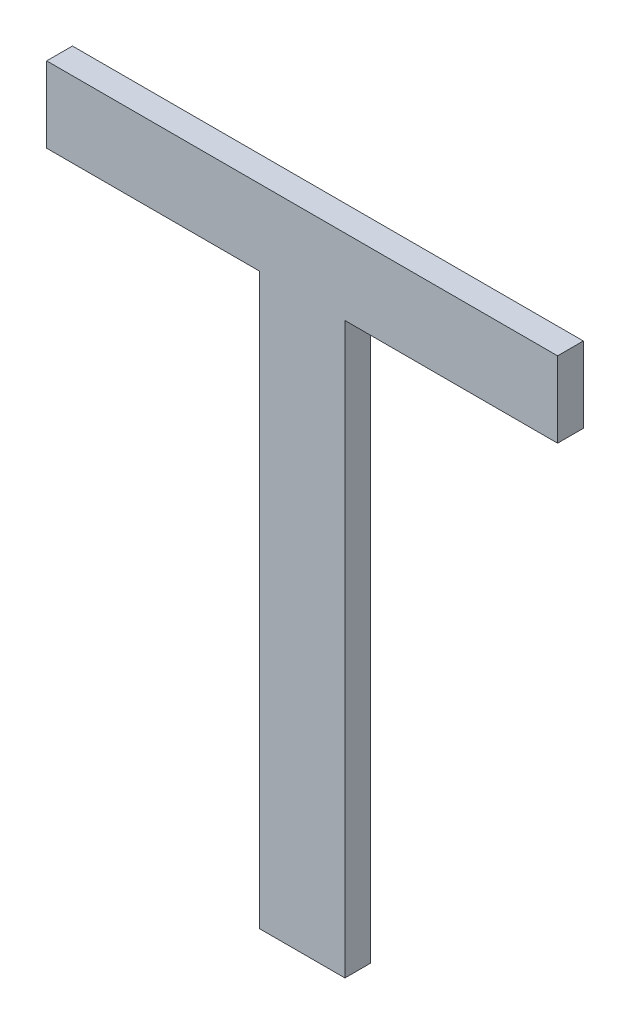
ISO-10303-21;
HEADER;
FILE_DESCRIPTION(('STEP AP214'),'2;1');
FILE_NAME('part.step','',(''),(''),'','','');
FILE_SCHEMA(('AUTOMOTIVE_DESIGN { 1 0 10303 214 1 1 1 1 }'));
ENDSEC;
DATA;
#1=APPLICATION_CONTEXT('core data for automotive mechanical design processes');
#2=APPLICATION_PROTOCOL_DEFINITION('international standard','automotive_design',2000,#1);
#3=PRODUCT_CONTEXT('',#1,'mechanical');
#4=PRODUCT('Part','Part','',(#3));
#5=PRODUCT_RELATED_PRODUCT_CATEGORY('part','',(#4));
#6=PRODUCT_DEFINITION_FORMATION('','',#4);
#7=PRODUCT_DEFINITION_CONTEXT('part definition',#1,'design');
#8=PRODUCT_DEFINITION('design','',#6,#7);
#9=PRODUCT_DEFINITION_SHAPE('','',#8);
#10=(LENGTH_UNIT() NAMED_UNIT(*) SI_UNIT(.MILLI.,.METRE.));
#11=(NAMED_UNIT(*) PLANE_ANGLE_UNIT() SI_UNIT($,.RADIAN.));
#12=(NAMED_UNIT(*) SI_UNIT($,.STERADIAN.) SOLID_ANGLE_UNIT());
#13=UNCERTAINTY_MEASURE_WITH_UNIT(LENGTH_MEASURE(1.E-05),#10,'distance_accuracy_value','');
#14=(GEOMETRIC_REPRESENTATION_CONTEXT(3) GLOBAL_UNCERTAINTY_ASSIGNED_CONTEXT((#13)) GLOBAL_UNIT_ASSIGNED_CONTEXT((#10,
#11,#12)) REPRESENTATION_CONTEXT('',''));
#15=CARTESIAN_POINT('',(0.,0.,0.));
#16=DIRECTION('',(0.,0.,1.));
#17=DIRECTION('',(1.,0.,0.));
#18=AXIS2_PLACEMENT_3D('',#15,#16,#17);
#19=CARTESIAN_POINT('',(2.328327092111,0.0543410911117402,1.59999999404));
#20=DIRECTION('',(0.,0.,1.));
#21=DIRECTION('',(1.,0.,0.));
#22=AXIS2_PLACEMENT_3D('',#19,#20,#21);
#23=PLANE('',#22);
#24=DIRECTION('',(0.,1.,0.));
#25=VECTOR('',#24,1.);
#26=CARTESIAN_POINT('',(2.526777128875,0.194164329953,1.59999999404));
#27=LINE('',#26,#25);
#28=CARTESIAN_POINT('',(2.526777128875,0.223564329371,1.59999999404));
#29=VERTEX_POINT('',#28);
#30=CARTESIAN_POINT('',(2.526777128875,0.164764330536,1.59999999404));
#31=VERTEX_POINT('',#30);
#32=EDGE_CURVE('E106',#29,#31,#27,.F.);
#33=ORIENTED_EDGE('',*,*,#32,.F.);
#34=DIRECTION('',(1.,0.,0.));
#35=VECTOR('',#34,1.);
#36=CARTESIAN_POINT('',(2.328327138722,0.223564329371,1.59999999404));
#37=LINE('',#36,#35);
#38=CARTESIAN_POINT('',(2.129877148569,0.223564329371,1.59999999404));
#39=VERTEX_POINT('',#38);
#40=EDGE_CURVE('E110',#39,#29,#37,.T.);
#41=ORIENTED_EDGE('',*,*,#40,.F.);
#42=DIRECTION('',(0.,1.,0.));
#43=VECTOR('',#42,1.);
#44=CARTESIAN_POINT('',(2.129877148569,0.194164329953,1.59999999404));
#45=LINE('',#44,#43);
#46=CARTESIAN_POINT('',(2.129877148569,0.164764330536,1.59999999404));
#47=VERTEX_POINT('',#46);
#48=EDGE_CURVE('E114',#47,#39,#45,.T.);
#49=ORIENTED_EDGE('',*,*,#48,.F.);
#50=DIRECTION('',(1.,0.,0.));
#51=VECTOR('',#50,1.);
#52=CARTESIAN_POINT('',(2.212477087229,0.164764330536,1.59999999404));
#53=LINE('',#52,#51);
#54=CARTESIAN_POINT('',(2.29507702589,0.164764330536,1.59999999404));
#55=VERTEX_POINT('',#54);
#56=EDGE_CURVE('E118',#55,#47,#53,.F.);
#57=ORIENTED_EDGE('',*,*,#56,.F.);
#58=DIRECTION('',(0.,1.,0.));
#59=VECTOR('',#58,1.);
#60=CARTESIAN_POINT('',(2.29507702589,-0.0564356695860601,1.59999999404));
#61=LINE('',#60,#59);
#62=CARTESIAN_POINT('',(2.29507702589,-0.277635669708,1.59999999404));
#63=VERTEX_POINT('',#62);
#64=EDGE_CURVE('E95',#63,#55,#61,.T.);
#65=ORIENTED_EDGE('',*,*,#64,.F.);
#66=DIRECTION('',(1.,0.,0.));
#67=VECTOR('',#66,1.);
#68=CARTESIAN_POINT('',(2.3283270441,-0.277635669708,1.59999999404));
#69=LINE('',#68,#67);
#70=CARTESIAN_POINT('',(2.361577062309,-0.277635669708,1.59999999404));
#71=VERTEX_POINT('',#70);
#72=EDGE_CURVE('E20',#71,#63,#69,.F.);
#73=ORIENTED_EDGE('',*,*,#72,.F.);
#74=DIRECTION('',(0.,1.,0.));
#75=VECTOR('',#74,1.);
#76=CARTESIAN_POINT('',(2.361577062309,-0.0564356695860601,1.59999999404));
#77=LINE('',#76,#75);
#78=CARTESIAN_POINT('',(2.361577062309,0.164764330536,1.59999999404));
#79=VERTEX_POINT('',#78);
#80=EDGE_CURVE('E83',#79,#71,#77,.F.);
#81=ORIENTED_EDGE('',*,*,#80,.F.);
#82=DIRECTION('',(1.,0.,0.));
#83=VECTOR('',#82,1.);
#84=CARTESIAN_POINT('',(2.444177095592,0.164764330536,1.59999999404));
#85=LINE('',#84,#83);
#86=EDGE_CURVE('E78',#31,#79,#85,.F.);
#87=ORIENTED_EDGE('',*,*,#86,.F.);
#88=EDGE_LOOP('',(#33,#41,#49,#57,#65,#73,#81,#87));
#89=FACE_BOUND('',#88,.T.);
#90=ADVANCED_FACE('F17',(#89),#23,.T.);
#91=CARTESIAN_POINT('',(2.3283270441,-0.277635669708,1.59999999404));
#92=DIRECTION('',(0.,-1.,0.));
#93=DIRECTION('',(0.,0.,-1.));
#94=AXIS2_PLACEMENT_3D('',#91,#92,#93);
#95=PLANE('',#94);
#96=DIRECTION('',(1.,0.,0.));
#97=VECTOR('',#96,1.);
#98=CARTESIAN_POINT('',(2.328327092111,-0.277635669708,1.57999999404));
#99=LINE('',#98,#97);
#100=CARTESIAN_POINT('',(2.29507702589,-0.277635669708,1.57999999404));
#101=VERTEX_POINT('',#100);
#102=CARTESIAN_POINT('',(2.361577062309,-0.277635669708,1.57999999404));
#103=VERTEX_POINT('',#102);
#104=EDGE_CURVE('E101',#101,#103,#99,.T.);
#105=ORIENTED_EDGE('',*,*,#104,.T.);
#106=DIRECTION('',(0.,0.,-1.));
#107=VECTOR('',#106,1.);
#108=CARTESIAN_POINT('',(2.361577062309,-0.277635669708,1.59999999404));
#109=LINE('',#108,#107);
#110=EDGE_CURVE('E88',#71,#103,#109,.T.);
#111=ORIENTED_EDGE('',*,*,#110,.F.);
#112=ORIENTED_EDGE('',*,*,#72,.T.);
#113=DIRECTION('',(0.,0.,1.));
#114=VECTOR('',#113,1.);
#115=CARTESIAN_POINT('',(2.29507702589,-0.277635669708,1.59999999404));
#116=LINE('',#115,#114);
#117=EDGE_CURVE('E124',#101,#63,#116,.T.);
#118=ORIENTED_EDGE('',*,*,#117,.F.);
#119=EDGE_LOOP('',(#105,#111,#112,#118));
#120=FACE_BOUND('',#119,.T.);
#121=ADVANCED_FACE('F100',(#120),#95,.T.);
#122=CARTESIAN_POINT('',(2.361577062309,-0.0564356695860601,1.59999999404));
#123=DIRECTION('',(1.,0.,0.));
#124=DIRECTION('',(0.,0.,-1.));
#125=AXIS2_PLACEMENT_3D('',#122,#123,#124);
#126=PLANE('',#125);
#127=DIRECTION('',(0.,1.,0.));
#128=VECTOR('',#127,1.);
#129=CARTESIAN_POINT('',(2.361577062309,0.0543410911117402,1.57999999404));
#130=LINE('',#129,#128);
#131=CARTESIAN_POINT('',(2.361577062309,0.164764330536,1.57999999404));
#132=VERTEX_POINT('',#131);
#133=EDGE_CURVE('E127',#103,#132,#130,.T.);
#134=ORIENTED_EDGE('',*,*,#133,.T.);
#135=DIRECTION('',(0.,0.,-1.));
#136=VECTOR('',#135,1.);
#137=CARTESIAN_POINT('',(2.361577062309,0.164764330536,1.59999999404));
#138=LINE('',#137,#136);
#139=EDGE_CURVE('E90',#79,#132,#138,.T.);
#140=ORIENTED_EDGE('',*,*,#139,.F.);
#141=ORIENTED_EDGE('',*,*,#80,.T.);
#142=ORIENTED_EDGE('',*,*,#110,.T.);
#143=EDGE_LOOP('',(#134,#140,#141,#142));
#144=FACE_BOUND('',#143,.T.);
#145=ADVANCED_FACE('F86',(#144),#126,.T.);
#146=CARTESIAN_POINT('',(2.444177095592,0.164764330536,1.59999999404));
#147=DIRECTION('',(0.,-1.,0.));
#148=DIRECTION('',(0.,0.,-1.));
#149=AXIS2_PLACEMENT_3D('',#146,#147,#148);
#150=PLANE('',#149);
#151=DIRECTION('',(1.,0.,0.));
#152=VECTOR('',#151,1.);
#153=CARTESIAN_POINT('',(2.328327092111,0.164764330536,1.57999999404));
#154=LINE('',#153,#152);
#155=CARTESIAN_POINT('',(2.526777128875,0.164764330536,1.57999999404));
#156=VERTEX_POINT('',#155);
#157=EDGE_CURVE('E129',#132,#156,#154,.T.);
#158=ORIENTED_EDGE('',*,*,#157,.T.);
#159=DIRECTION('',(0.,0.,-1.));
#160=VECTOR('',#159,1.);
#161=CARTESIAN_POINT('',(2.526777128875,0.164764330536,1.59999999404));
#162=LINE('',#161,#160);
#163=EDGE_CURVE('E108',#31,#156,#162,.T.);
#164=ORIENTED_EDGE('',*,*,#163,.F.);
#165=ORIENTED_EDGE('',*,*,#86,.T.);
#166=ORIENTED_EDGE('',*,*,#139,.T.);
#167=EDGE_LOOP('',(#158,#164,#165,#166));
#168=FACE_BOUND('',#167,.T.);
#169=ADVANCED_FACE('F162',(#168),#150,.T.);
#170=CARTESIAN_POINT('',(2.526777128875,0.194164329953,1.59999999404));
#171=DIRECTION('',(1.,0.,0.));
#172=DIRECTION('',(0.,0.,-1.));
#173=AXIS2_PLACEMENT_3D('',#170,#171,#172);
#174=PLANE('',#173);
#175=DIRECTION('',(0.,1.,0.));
#176=VECTOR('',#175,1.);
#177=CARTESIAN_POINT('',(2.526777128875,0.0543410911117402,1.57999999404));
#178=LINE('',#177,#176);
#179=CARTESIAN_POINT('',(2.526777128875,0.223564329371,1.57999999404));
#180=VERTEX_POINT('',#179);
#181=EDGE_CURVE('E132',#156,#180,#178,.T.);
#182=ORIENTED_EDGE('',*,*,#181,.T.);
#183=DIRECTION('',(0.,0.,1.));
#184=VECTOR('',#183,1.);
#185=CARTESIAN_POINT('',(2.526777128875,0.223564329371,1.59999999404));
#186=LINE('',#185,#184);
#187=EDGE_CURVE('E112',#29,#180,#186,.F.);
#188=ORIENTED_EDGE('',*,*,#187,.F.);
#189=ORIENTED_EDGE('',*,*,#32,.T.);
#190=ORIENTED_EDGE('',*,*,#163,.T.);
#191=EDGE_LOOP('',(#182,#188,#189,#190));
#192=FACE_BOUND('',#191,.T.);
#193=ADVANCED_FACE('F161',(#192),#174,.T.);
#194=CARTESIAN_POINT('',(2.328327138722,0.223564329371,1.59999999404));
#195=DIRECTION('',(0.,1.,0.));
#196=DIRECTION('',(0.,0.,1.));
#197=AXIS2_PLACEMENT_3D('',#194,#195,#196);
#198=PLANE('',#197);
#199=DIRECTION('',(1.,0.,0.));
#200=VECTOR('',#199,1.);
#201=CARTESIAN_POINT('',(2.328327092111,0.223564329371,1.57999999404));
#202=LINE('',#201,#200);
#203=CARTESIAN_POINT('',(2.129877148569,0.223564329371,1.57999999404));
#204=VERTEX_POINT('',#203);
#205=EDGE_CURVE('E135',#180,#204,#202,.F.);
#206=ORIENTED_EDGE('',*,*,#205,.T.);
#207=DIRECTION('',(0.,0.,1.));
#208=VECTOR('',#207,1.);
#209=CARTESIAN_POINT('',(2.129877148569,0.223564329371,1.59999999404));
#210=LINE('',#209,#208);
#211=EDGE_CURVE('E116',#39,#204,#210,.F.);
#212=ORIENTED_EDGE('',*,*,#211,.F.);
#213=ORIENTED_EDGE('',*,*,#40,.T.);
#214=ORIENTED_EDGE('',*,*,#187,.T.);
#215=EDGE_LOOP('',(#206,#212,#213,#214));
#216=FACE_BOUND('',#215,.T.);
#217=ADVANCED_FACE('F156',(#216),#198,.T.);
#218=CARTESIAN_POINT('',(2.129877148569,0.194164329953,1.59999999404));
#219=DIRECTION('',(-1.,0.,0.));
#220=DIRECTION('',(0.,0.,1.));
#221=AXIS2_PLACEMENT_3D('',#218,#219,#220);
#222=PLANE('',#221);
#223=DIRECTION('',(0.,1.,0.));
#224=VECTOR('',#223,1.);
#225=CARTESIAN_POINT('',(2.129877148569,0.0543410911117402,1.57999999404));
#226=LINE('',#225,#224);
#227=CARTESIAN_POINT('',(2.129877148569,0.164764330536,1.57999999404));
#228=VERTEX_POINT('',#227);
#229=EDGE_CURVE('E138',#204,#228,#226,.F.);
#230=ORIENTED_EDGE('',*,*,#229,.T.);
#231=DIRECTION('',(0.,0.,-1.));
#232=VECTOR('',#231,1.);
#233=CARTESIAN_POINT('',(2.129877148569,0.164764330536,1.59999999404));
#234=LINE('',#233,#232);
#235=EDGE_CURVE('E120',#47,#228,#234,.T.);
#236=ORIENTED_EDGE('',*,*,#235,.F.);
#237=ORIENTED_EDGE('',*,*,#48,.T.);
#238=ORIENTED_EDGE('',*,*,#211,.T.);
#239=EDGE_LOOP('',(#230,#236,#237,#238));
#240=FACE_BOUND('',#239,.T.);
#241=ADVANCED_FACE('F151',(#240),#222,.T.);
#242=CARTESIAN_POINT('',(2.212477087229,0.164764330536,1.59999999404));
#243=DIRECTION('',(0.,-1.,0.));
#244=DIRECTION('',(0.,0.,-1.));
#245=AXIS2_PLACEMENT_3D('',#242,#243,#244);
#246=PLANE('',#245);
#247=DIRECTION('',(1.,0.,0.));
#248=VECTOR('',#247,1.);
#249=CARTESIAN_POINT('',(2.328327092111,0.164764330536,1.57999999404));
#250=LINE('',#249,#248);
#251=CARTESIAN_POINT('',(2.29507702589,0.164764330536,1.57999999404));
#252=VERTEX_POINT('',#251);
#253=EDGE_CURVE('E26',#228,#252,#250,.T.);
#254=ORIENTED_EDGE('',*,*,#253,.T.);
#255=DIRECTION('',(0.,0.,1.));
#256=VECTOR('',#255,1.);
#257=CARTESIAN_POINT('',(2.29507702589,0.164764330536,1.59999999404));
#258=LINE('',#257,#256);
#259=EDGE_CURVE('E34',#55,#252,#258,.F.);
#260=ORIENTED_EDGE('',*,*,#259,.F.);
#261=ORIENTED_EDGE('',*,*,#56,.T.);
#262=ORIENTED_EDGE('',*,*,#235,.T.);
#263=EDGE_LOOP('',(#254,#260,#261,#262));
#264=FACE_BOUND('',#263,.T.);
#265=ADVANCED_FACE('F144',(#264),#246,.T.);
#266=CARTESIAN_POINT('',(2.29507702589,-0.0564356695860601,1.59999999404));
#267=DIRECTION('',(-1.,0.,0.));
#268=DIRECTION('',(0.,0.,1.));
#269=AXIS2_PLACEMENT_3D('',#266,#267,#268);
#270=PLANE('',#269);
#271=DIRECTION('',(0.,1.,0.));
#272=VECTOR('',#271,1.);
#273=CARTESIAN_POINT('',(2.29507702589,0.0543410911117402,1.57999999404));
#274=LINE('',#273,#272);
#275=EDGE_CURVE('E11',#252,#101,#274,.F.);
#276=ORIENTED_EDGE('',*,*,#275,.T.);
#277=ORIENTED_EDGE('',*,*,#117,.T.);
#278=ORIENTED_EDGE('',*,*,#64,.T.);
#279=ORIENTED_EDGE('',*,*,#259,.T.);
#280=EDGE_LOOP('',(#276,#277,#278,#279));
#281=FACE_BOUND('',#280,.T.);
#282=ADVANCED_FACE('F163',(#281),#270,.T.);
#283=CARTESIAN_POINT('',(2.328327092111,0.0543410911117402,1.57999999404));
#284=DIRECTION('',(0.,0.,1.));
#285=DIRECTION('',(1.,0.,0.));
#286=AXIS2_PLACEMENT_3D('',#283,#284,#285);
#287=PLANE('',#286);
#288=ORIENTED_EDGE('',*,*,#253,.F.);
#289=ORIENTED_EDGE('',*,*,#229,.F.);
#290=ORIENTED_EDGE('',*,*,#205,.F.);
#291=ORIENTED_EDGE('',*,*,#181,.F.);
#292=ORIENTED_EDGE('',*,*,#157,.F.);
#293=ORIENTED_EDGE('',*,*,#133,.F.);
#294=ORIENTED_EDGE('',*,*,#104,.F.);
#295=ORIENTED_EDGE('',*,*,#275,.F.);
#296=EDGE_LOOP('',(#288,#289,#290,#291,#292,#293,#294,#295));
#297=FACE_BOUND('',#296,.T.);
#298=ADVANCED_FACE('F148',(#297),#287,.F.);
#299=CLOSED_SHELL('',(#90,#121,#145,#169,#193,#217,#241,#265,#282,#298));
#300=MANIFOLD_SOLID_BREP('B1',#299);
#301=ADVANCED_BREP_SHAPE_REPRESENTATION('',(#18,#300),#14);
#302=SHAPE_DEFINITION_REPRESENTATION(#9,#301);
ENDSEC;
END-ISO-10303-21;
